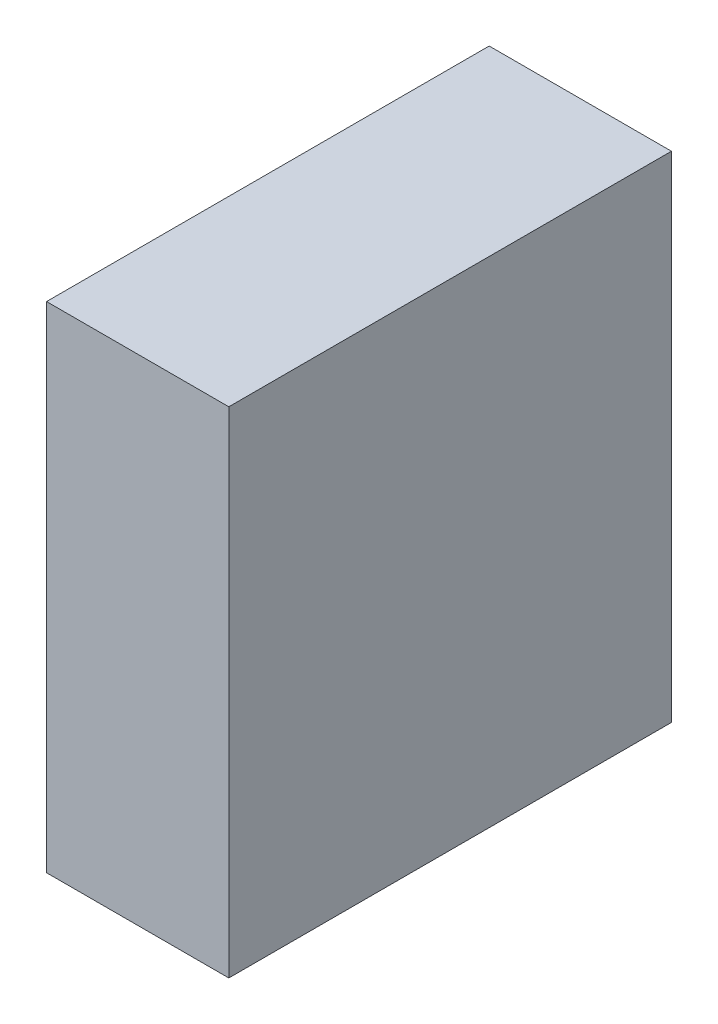
ISO-10303-21;
HEADER;
FILE_DESCRIPTION(('STEP AP214'),'2;1');
FILE_NAME('part.step','',(''),(''),'','','');
FILE_SCHEMA(('AUTOMOTIVE_DESIGN { 1 0 10303 214 1 1 1 1 }'));
ENDSEC;
DATA;
#1=APPLICATION_CONTEXT('core data for automotive mechanical design processes');
#2=APPLICATION_PROTOCOL_DEFINITION('international standard','automotive_design',2000,#1);
#3=PRODUCT_CONTEXT('',#1,'mechanical');
#4=PRODUCT('Part','Part','',(#3));
#5=PRODUCT_RELATED_PRODUCT_CATEGORY('part','',(#4));
#6=PRODUCT_DEFINITION_FORMATION('','',#4);
#7=PRODUCT_DEFINITION_CONTEXT('part definition',#1,'design');
#8=PRODUCT_DEFINITION('design','',#6,#7);
#9=PRODUCT_DEFINITION_SHAPE('','',#8);
#10=(LENGTH_UNIT() NAMED_UNIT(*) SI_UNIT(.MILLI.,.METRE.));
#11=(NAMED_UNIT(*) PLANE_ANGLE_UNIT() SI_UNIT($,.RADIAN.));
#12=(NAMED_UNIT(*) SI_UNIT($,.STERADIAN.) SOLID_ANGLE_UNIT());
#13=UNCERTAINTY_MEASURE_WITH_UNIT(LENGTH_MEASURE(1.E-05),#10,'distance_accuracy_value','');
#14=(GEOMETRIC_REPRESENTATION_CONTEXT(3) GLOBAL_UNCERTAINTY_ASSIGNED_CONTEXT((#13)) GLOBAL_UNIT_ASSIGNED_CONTEXT((#10,
#11,#12)) REPRESENTATION_CONTEXT('',''));
#15=CARTESIAN_POINT('',(0.,0.,0.));
#16=DIRECTION('',(0.,0.,1.));
#17=DIRECTION('',(1.,0.,0.));
#18=AXIS2_PLACEMENT_3D('',#15,#16,#17);
#19=CARTESIAN_POINT('',(0.17500092,-0.47499778,0.));
#20=DIRECTION('',(-1.,0.,0.));
#21=DIRECTION('',(0.,1.,0.));
#22=AXIS2_PLACEMENT_3D('',#19,#20,#21);
#23=PLANE('',#22);
#24=DIRECTION('',(0.,1.,0.));
#25=VECTOR('',#24,1.);
#26=CARTESIAN_POINT('',(0.17500092,-0.47499778,0.));
#27=LINE('',#26,#25);
#28=CARTESIAN_POINT('',(0.17500092,-0.47499778,0.));
#29=VERTEX_POINT('',#28);
#30=CARTESIAN_POINT('',(0.17500092,0.47500032,0.));
#31=VERTEX_POINT('',#30);
#32=EDGE_CURVE('E11',#29,#31,#27,.T.);
#33=ORIENTED_EDGE('',*,*,#32,.T.);
#34=DIRECTION('',(0.,0.,1.));
#35=VECTOR('',#34,1.);
#36=CARTESIAN_POINT('',(0.17500092,0.47500032,0.));
#37=LINE('',#36,#35);
#38=CARTESIAN_POINT('',(0.17500092,0.47500032,0.85000084));
#39=VERTEX_POINT('',#38);
#40=EDGE_CURVE('E24',#31,#39,#37,.T.);
#41=ORIENTED_EDGE('',*,*,#40,.T.);
#42=DIRECTION('',(0.,1.,0.));
#43=VECTOR('',#42,1.);
#44=CARTESIAN_POINT('',(0.17500092,-0.47499778,0.85000084));
#45=LINE('',#44,#43);
#46=CARTESIAN_POINT('',(0.17500092,-0.47499778,0.85000084));
#47=VERTEX_POINT('',#46);
#48=EDGE_CURVE('E87',#47,#39,#45,.T.);
#49=ORIENTED_EDGE('',*,*,#48,.F.);
#50=DIRECTION('',(0.,0.,1.));
#51=VECTOR('',#50,1.);
#52=CARTESIAN_POINT('',(0.17500092,-0.47499778,0.));
#53=LINE('',#52,#51);
#54=EDGE_CURVE('E36',#29,#47,#53,.T.);
#55=ORIENTED_EDGE('',*,*,#54,.F.);
#56=EDGE_LOOP('',(#33,#41,#49,#55));
#57=FACE_BOUND('',#56,.T.);
#58=ADVANCED_FACE('F17',(#57),#23,.F.);
#59=CARTESIAN_POINT('',(0.17500092,0.47500032,0.));
#60=DIRECTION('',(0.,-1.,0.));
#61=DIRECTION('',(-1.,0.,0.));
#62=AXIS2_PLACEMENT_3D('',#59,#60,#61);
#63=PLANE('',#62);
#64=DIRECTION('',(-1.,0.,0.));
#65=VECTOR('',#64,1.);
#66=CARTESIAN_POINT('',(0.17500092,0.47500032,0.));
#67=LINE('',#66,#65);
#68=CARTESIAN_POINT('',(-0.17499838,0.47500032,0.));
#69=VERTEX_POINT('',#68);
#70=EDGE_CURVE('E84',#31,#69,#67,.T.);
#71=ORIENTED_EDGE('',*,*,#70,.T.);
#72=DIRECTION('',(0.,0.,1.));
#73=VECTOR('',#72,1.);
#74=CARTESIAN_POINT('',(-0.17499838,0.47500032,0.));
#75=LINE('',#74,#73);
#76=CARTESIAN_POINT('',(-0.17499838,0.47500032,0.85000084));
#77=VERTEX_POINT('',#76);
#78=EDGE_CURVE('E82',#69,#77,#75,.T.);
#79=ORIENTED_EDGE('',*,*,#78,.T.);
#80=DIRECTION('',(-1.,0.,0.));
#81=VECTOR('',#80,1.);
#82=CARTESIAN_POINT('',(0.17500092,0.47500032,0.85000084));
#83=LINE('',#82,#81);
#84=EDGE_CURVE('E62',#39,#77,#83,.T.);
#85=ORIENTED_EDGE('',*,*,#84,.F.);
#86=ORIENTED_EDGE('',*,*,#40,.F.);
#87=EDGE_LOOP('',(#71,#79,#85,#86));
#88=FACE_BOUND('',#87,.T.);
#89=ADVANCED_FACE('F89',(#88),#63,.F.);
#90=CARTESIAN_POINT('',(-0.17499838,0.47500032,0.));
#91=DIRECTION('',(1.,0.,0.));
#92=DIRECTION('',(0.,-1.,0.));
#93=AXIS2_PLACEMENT_3D('',#90,#91,#92);
#94=PLANE('',#93);
#95=DIRECTION('',(0.,-1.,0.));
#96=VECTOR('',#95,1.);
#97=CARTESIAN_POINT('',(-0.17499838,0.47500032,0.));
#98=LINE('',#97,#96);
#99=CARTESIAN_POINT('',(-0.17499838,-0.47499778,0.));
#100=VERTEX_POINT('',#99);
#101=EDGE_CURVE('E71',#69,#100,#98,.T.);
#102=ORIENTED_EDGE('',*,*,#101,.T.);
#103=DIRECTION('',(0.,0.,1.));
#104=VECTOR('',#103,1.);
#105=CARTESIAN_POINT('',(-0.17499838,-0.47499778,0.));
#106=LINE('',#105,#104);
#107=CARTESIAN_POINT('',(-0.17499838,-0.47499778,0.85000084));
#108=VERTEX_POINT('',#107);
#109=EDGE_CURVE('E65',#100,#108,#106,.T.);
#110=ORIENTED_EDGE('',*,*,#109,.T.);
#111=DIRECTION('',(0.,-1.,0.));
#112=VECTOR('',#111,1.);
#113=CARTESIAN_POINT('',(-0.17499838,0.47500032,0.85000084));
#114=LINE('',#113,#112);
#115=EDGE_CURVE('E57',#77,#108,#114,.T.);
#116=ORIENTED_EDGE('',*,*,#115,.F.);
#117=ORIENTED_EDGE('',*,*,#78,.F.);
#118=EDGE_LOOP('',(#102,#110,#116,#117));
#119=FACE_BOUND('',#118,.T.);
#120=ADVANCED_FACE('F69',(#119),#94,.F.);
#121=CARTESIAN_POINT('',(-0.17499838,-0.47499778,0.));
#122=DIRECTION('',(0.,1.,0.));
#123=DIRECTION('',(1.,0.,0.));
#124=AXIS2_PLACEMENT_3D('',#121,#122,#123);
#125=PLANE('',#124);
#126=DIRECTION('',(1.,0.,0.));
#127=VECTOR('',#126,1.);
#128=CARTESIAN_POINT('',(-0.17499838,-0.47499778,0.));
#129=LINE('',#128,#127);
#130=EDGE_CURVE('E66',#100,#29,#129,.T.);
#131=ORIENTED_EDGE('',*,*,#130,.T.);
#132=ORIENTED_EDGE('',*,*,#54,.T.);
#133=DIRECTION('',(1.,0.,0.));
#134=VECTOR('',#133,1.);
#135=CARTESIAN_POINT('',(-0.17499838,-0.47499778,0.85000084));
#136=LINE('',#135,#134);
#137=EDGE_CURVE('E61',#108,#47,#136,.T.);
#138=ORIENTED_EDGE('',*,*,#137,.F.);
#139=ORIENTED_EDGE('',*,*,#109,.F.);
#140=EDGE_LOOP('',(#131,#132,#138,#139));
#141=FACE_BOUND('',#140,.T.);
#142=ADVANCED_FACE('F76',(#141),#125,.F.);
#143=CARTESIAN_POINT('',(0.17500092,-0.47499778,0.));
#144=DIRECTION('',(0.,0.,-1.));
#145=DIRECTION('',(-1.,0.,0.));
#146=AXIS2_PLACEMENT_3D('',#143,#144,#145);
#147=PLANE('',#146);
#148=ORIENTED_EDGE('',*,*,#130,.F.);
#149=ORIENTED_EDGE('',*,*,#101,.F.);
#150=ORIENTED_EDGE('',*,*,#70,.F.);
#151=ORIENTED_EDGE('',*,*,#32,.F.);
#152=EDGE_LOOP('',(#148,#149,#150,#151));
#153=FACE_BOUND('',#152,.T.);
#154=ADVANCED_FACE('F91',(#153),#147,.T.);
#155=CARTESIAN_POINT('',(0.17500092,-0.47499778,0.85000084));
#156=DIRECTION('',(0.,0.,-1.));
#157=DIRECTION('',(-1.,0.,0.));
#158=AXIS2_PLACEMENT_3D('',#155,#156,#157);
#159=PLANE('',#158);
#160=ORIENTED_EDGE('',*,*,#48,.T.);
#161=ORIENTED_EDGE('',*,*,#84,.T.);
#162=ORIENTED_EDGE('',*,*,#115,.T.);
#163=ORIENTED_EDGE('',*,*,#137,.T.);
#164=EDGE_LOOP('',(#160,#161,#162,#163));
#165=FACE_BOUND('',#164,.T.);
#166=ADVANCED_FACE('F59',(#165),#159,.F.);
#167=CLOSED_SHELL('',(#58,#89,#120,#142,#154,#166));
#168=MANIFOLD_SOLID_BREP('B1',#167);
#169=ADVANCED_BREP_SHAPE_REPRESENTATION('',(#18,#168),#14);
#170=SHAPE_DEFINITION_REPRESENTATION(#9,#169);
ENDSEC;
END-ISO-10303-21;
